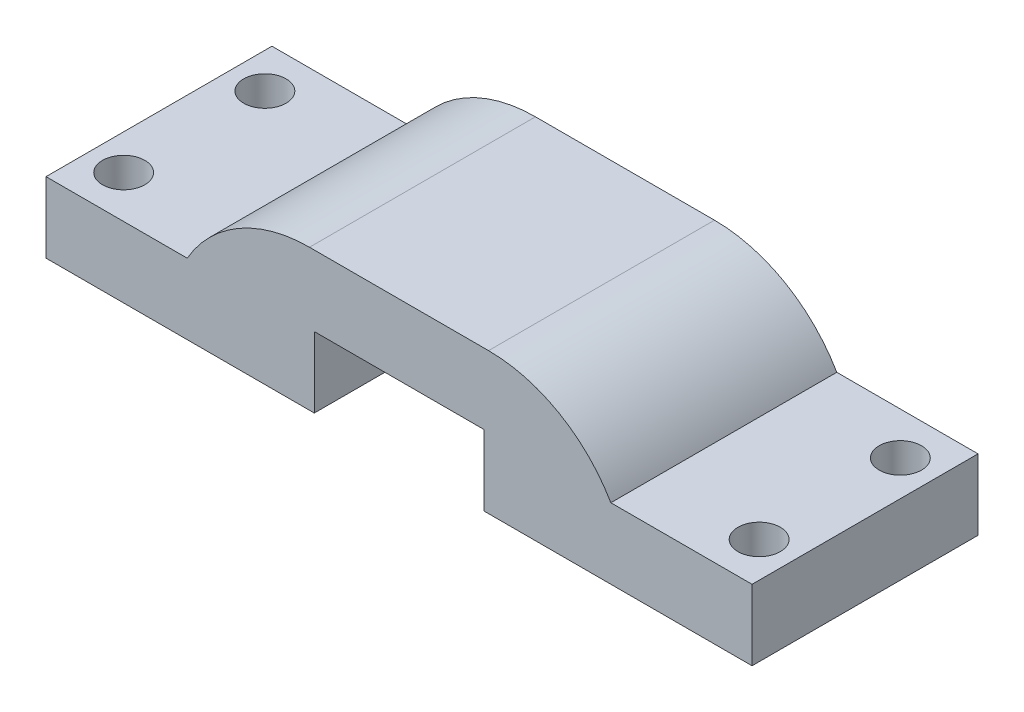
ISO-10303-21;
HEADER;
FILE_DESCRIPTION(('STEP AP214'),'2;1');
FILE_NAME('part.step','',(''),(''),'','','');
FILE_SCHEMA(('AUTOMOTIVE_DESIGN { 1 0 10303 214 1 1 1 1 }'));
ENDSEC;
DATA;
#1=APPLICATION_CONTEXT('core data for automotive mechanical design processes');
#2=APPLICATION_PROTOCOL_DEFINITION('international standard','automotive_design',2000,#1);
#3=PRODUCT_CONTEXT('',#1,'mechanical');
#4=PRODUCT('Part','Part','',(#3));
#5=PRODUCT_RELATED_PRODUCT_CATEGORY('part','',(#4));
#6=PRODUCT_DEFINITION_FORMATION('','',#4);
#7=PRODUCT_DEFINITION_CONTEXT('part definition',#1,'design');
#8=PRODUCT_DEFINITION('design','',#6,#7);
#9=PRODUCT_DEFINITION_SHAPE('','',#8);
#10=(LENGTH_UNIT() NAMED_UNIT(*) SI_UNIT(.MILLI.,.METRE.));
#11=(NAMED_UNIT(*) PLANE_ANGLE_UNIT() SI_UNIT($,.RADIAN.));
#12=(NAMED_UNIT(*) SI_UNIT($,.STERADIAN.) SOLID_ANGLE_UNIT());
#13=UNCERTAINTY_MEASURE_WITH_UNIT(LENGTH_MEASURE(1.E-05),#10,'distance_accuracy_value','');
#14=(GEOMETRIC_REPRESENTATION_CONTEXT(3) GLOBAL_UNCERTAINTY_ASSIGNED_CONTEXT((#13)) GLOBAL_UNIT_ASSIGNED_CONTEXT((#10,
#11,#12)) REPRESENTATION_CONTEXT('',''));
#15=CARTESIAN_POINT('',(0.,0.,0.));
#16=DIRECTION('',(0.,0.,1.));
#17=DIRECTION('',(1.,0.,0.));
#18=AXIS2_PLACEMENT_3D('',#15,#16,#17);
#19=CARTESIAN_POINT('',(9.86879837167113,0.,16.));
#20=DIRECTION('',(-1.,0.,0.));
#21=DIRECTION('',(0.,0.,1.));
#22=AXIS2_PLACEMENT_3D('',#19,#20,#21);
#23=PLANE('',#22);
#24=DIRECTION('',(0.,1.,0.));
#25=VECTOR('',#24,1.);
#26=CARTESIAN_POINT('',(9.86879837167113,0.,0.));
#27=LINE('',#26,#25);
#28=CARTESIAN_POINT('',(9.86879837167113,-27.1660126804046,0.));
#29=VERTEX_POINT('',#28);
#30=CARTESIAN_POINT('',(9.86879837167113,-22.1660126804046,0.));
#31=VERTEX_POINT('',#30);
#32=EDGE_CURVE('E130',#29,#31,#27,.T.);
#33=ORIENTED_EDGE('',*,*,#32,.F.);
#34=DIRECTION('',(0.,0.,-1.));
#35=VECTOR('',#34,1.);
#36=CARTESIAN_POINT('',(9.86879837167113,-27.1660126804046,16.));
#37=LINE('',#36,#35);
#38=CARTESIAN_POINT('',(9.86879837167113,-27.1660126804046,16.));
#39=VERTEX_POINT('',#38);
#40=EDGE_CURVE('E125',#39,#29,#37,.T.);
#41=ORIENTED_EDGE('',*,*,#40,.F.);
#42=DIRECTION('',(0.,1.,0.));
#43=VECTOR('',#42,1.);
#44=CARTESIAN_POINT('',(9.86879837167113,0.,16.));
#45=LINE('',#44,#43);
#46=CARTESIAN_POINT('',(9.86879837167113,-22.1660126804046,16.));
#47=VERTEX_POINT('',#46);
#48=EDGE_CURVE('E128',#39,#47,#45,.T.);
#49=ORIENTED_EDGE('',*,*,#48,.T.);
#50=DIRECTION('',(0.,0.,-1.));
#51=VECTOR('',#50,1.);
#52=CARTESIAN_POINT('',(9.86879837167113,-22.1660126804046,16.));
#53=LINE('',#52,#51);
#54=EDGE_CURVE('E171',#47,#31,#53,.T.);
#55=ORIENTED_EDGE('',*,*,#54,.T.);
#56=EDGE_LOOP('',(#33,#41,#49,#55));
#57=FACE_BOUND('',#56,.T.);
#58=ADVANCED_FACE('F36',(#57),#23,.T.);
#59=CARTESIAN_POINT('',(0.,-27.1660126804046,16.));
#60=DIRECTION('',(0.,1.,0.));
#61=DIRECTION('',(0.,0.,1.));
#62=AXIS2_PLACEMENT_3D('',#59,#60,#61);
#63=PLANE('',#62);
#64=CARTESIAN_POINT('',(26.3687983716711,-27.1660126804046,3.));
#65=DIRECTION('',(0.,1.,0.));
#66=DIRECTION('',(0.,0.,1.));
#67=AXIS2_PLACEMENT_3D('',#64,#65,#66);
#68=CIRCLE('',#67,1.5);
#69=CARTESIAN_POINT('',(26.3687983716711,-27.1660126804046,4.5));
#70=VERTEX_POINT('',#69);
#71=EDGE_CURVE('E333',#70,#70,#68,.T.);
#72=ORIENTED_EDGE('',*,*,#71,.T.);
#73=EDGE_LOOP('',(#72));
#74=FACE_BOUND('',#73,.T.);
#75=CARTESIAN_POINT('',(26.3687983716711,-27.1660126804046,13.));
#76=DIRECTION('',(0.,1.,0.));
#77=DIRECTION('',(0.,0.,1.));
#78=AXIS2_PLACEMENT_3D('',#75,#76,#77);
#79=CIRCLE('',#78,1.5);
#80=CARTESIAN_POINT('',(26.3687983716711,-27.1660126804046,14.5));
#81=VERTEX_POINT('',#80);
#82=EDGE_CURVE('E336',#81,#81,#79,.T.);
#83=ORIENTED_EDGE('',*,*,#82,.T.);
#84=EDGE_LOOP('',(#83));
#85=FACE_BOUND('',#84,.T.);
#86=DIRECTION('',(1.,0.,0.));
#87=VECTOR('',#86,1.);
#88=CARTESIAN_POINT('',(0.,-27.1660126804046,0.));
#89=LINE('',#88,#87);
#90=CARTESIAN_POINT('',(28.8687983716711,-27.1660126804046,0.));
#91=VERTEX_POINT('',#90);
#92=EDGE_CURVE('E173',#29,#91,#89,.T.);
#93=ORIENTED_EDGE('',*,*,#92,.T.);
#94=DIRECTION('',(0.,0.,-1.));
#95=VECTOR('',#94,1.);
#96=CARTESIAN_POINT('',(28.8687983716711,-27.1660126804046,16.));
#97=LINE('',#96,#95);
#98=CARTESIAN_POINT('',(28.8687983716711,-27.1660126804046,16.));
#99=VERTEX_POINT('',#98);
#100=EDGE_CURVE('E134',#99,#91,#97,.T.);
#101=ORIENTED_EDGE('',*,*,#100,.F.);
#102=DIRECTION('',(1.,0.,0.));
#103=VECTOR('',#102,1.);
#104=CARTESIAN_POINT('',(0.,-27.1660126804046,16.));
#105=LINE('',#104,#103);
#106=EDGE_CURVE('E137',#39,#99,#105,.T.);
#107=ORIENTED_EDGE('',*,*,#106,.F.);
#108=ORIENTED_EDGE('',*,*,#40,.T.);
#109=EDGE_LOOP('',(#93,#101,#107,#108));
#110=FACE_BOUND('',#109,.T.);
#111=ADVANCED_FACE('F138',(#74,#85,#110),#63,.F.);
#112=CARTESIAN_POINT('',(28.8687983716711,0.,16.));
#113=DIRECTION('',(-1.,0.,0.));
#114=DIRECTION('',(0.,-1.,0.));
#115=AXIS2_PLACEMENT_3D('',#112,#113,#114);
#116=PLANE('',#115);
#117=DIRECTION('',(0.,1.,0.));
#118=VECTOR('',#117,1.);
#119=CARTESIAN_POINT('',(28.8687983716711,0.,0.));
#120=LINE('',#119,#118);
#121=CARTESIAN_POINT('',(28.8687983716711,-22.1660126804046,0.));
#122=VERTEX_POINT('',#121);
#123=EDGE_CURVE('E176',#91,#122,#120,.T.);
#124=ORIENTED_EDGE('',*,*,#123,.T.);
#125=DIRECTION('',(0.,0.,-1.));
#126=VECTOR('',#125,1.);
#127=CARTESIAN_POINT('',(28.8687983716711,-22.1660126804046,16.));
#128=LINE('',#127,#126);
#129=CARTESIAN_POINT('',(28.8687983716711,-22.1660126804046,16.));
#130=VERTEX_POINT('',#129);
#131=EDGE_CURVE('E210',#130,#122,#128,.T.);
#132=ORIENTED_EDGE('',*,*,#131,.F.);
#133=DIRECTION('',(0.,1.,0.));
#134=VECTOR('',#133,1.);
#135=CARTESIAN_POINT('',(28.8687983716711,0.,16.));
#136=LINE('',#135,#134);
#137=EDGE_CURVE('E141',#99,#130,#136,.T.);
#138=ORIENTED_EDGE('',*,*,#137,.F.);
#139=ORIENTED_EDGE('',*,*,#100,.T.);
#140=EDGE_LOOP('',(#124,#132,#138,#139));
#141=FACE_BOUND('',#140,.T.);
#142=ADVANCED_FACE('F260',(#141),#116,.F.);
#143=CARTESIAN_POINT('',(0.,-22.1660126804046,16.));
#144=DIRECTION('',(0.,1.,0.));
#145=DIRECTION('',(0.,0.,1.));
#146=AXIS2_PLACEMENT_3D('',#143,#144,#145);
#147=PLANE('',#146);
#148=CARTESIAN_POINT('',(26.3687983716711,-22.1660126804046,3.));
#149=DIRECTION('',(0.,1.,0.));
#150=DIRECTION('',(0.,0.,1.));
#151=AXIS2_PLACEMENT_3D('',#148,#149,#150);
#152=CIRCLE('',#151,1.5);
#153=CARTESIAN_POINT('',(26.3687983716711,-22.1660126804046,4.5));
#154=VERTEX_POINT('',#153);
#155=EDGE_CURVE('E174',#154,#154,#152,.F.);
#156=ORIENTED_EDGE('',*,*,#155,.T.);
#157=EDGE_LOOP('',(#156));
#158=FACE_BOUND('',#157,.T.);
#159=CARTESIAN_POINT('',(26.3687983716711,-22.1660126804046,13.));
#160=DIRECTION('',(0.,1.,0.));
#161=DIRECTION('',(0.,0.,1.));
#162=AXIS2_PLACEMENT_3D('',#159,#160,#161);
#163=CIRCLE('',#162,1.5);
#164=CARTESIAN_POINT('',(26.3687983716711,-22.1660126804046,14.5));
#165=VERTEX_POINT('',#164);
#166=EDGE_CURVE('E213',#165,#165,#163,.F.);
#167=ORIENTED_EDGE('',*,*,#166,.T.);
#168=EDGE_LOOP('',(#167));
#169=FACE_BOUND('',#168,.T.);
#170=DIRECTION('',(1.,0.,0.));
#171=VECTOR('',#170,1.);
#172=CARTESIAN_POINT('',(0.,-22.1660126804046,0.));
#173=LINE('',#172,#171);
#174=CARTESIAN_POINT('',(18.8687983716711,-22.1660126804046,0.));
#175=VERTEX_POINT('',#174);
#176=EDGE_CURVE('E179',#175,#122,#173,.T.);
#177=ORIENTED_EDGE('',*,*,#176,.F.);
#178=DIRECTION('',(0.,0.,-1.));
#179=VECTOR('',#178,1.);
#180=CARTESIAN_POINT('',(18.8687983716711,-22.1660126804046,16.));
#181=LINE('',#180,#179);
#182=CARTESIAN_POINT('',(18.8687983716711,-22.1660126804046,16.));
#183=VERTEX_POINT('',#182);
#184=EDGE_CURVE('E207',#183,#175,#181,.T.);
#185=ORIENTED_EDGE('',*,*,#184,.F.);
#186=DIRECTION('',(1.,0.,0.));
#187=VECTOR('',#186,1.);
#188=CARTESIAN_POINT('',(0.,-22.1660126804046,16.));
#189=LINE('',#188,#187);
#190=EDGE_CURVE('E157',#183,#130,#189,.T.);
#191=ORIENTED_EDGE('',*,*,#190,.T.);
#192=ORIENTED_EDGE('',*,*,#131,.T.);
#193=EDGE_LOOP('',(#177,#185,#191,#192));
#194=FACE_BOUND('',#193,.T.);
#195=ADVANCED_FACE('F263',(#158,#169,#194),#147,.T.);
#196=CARTESIAN_POINT('',(0.,-17.1660126804046,16.));
#197=DIRECTION('',(0.,-1.,0.));
#198=DIRECTION('',(0.,0.,-1.));
#199=AXIS2_PLACEMENT_3D('',#196,#197,#198);
#200=PLANE('',#199);
#201=DIRECTION('',(-1.,0.,0.));
#202=VECTOR('',#201,1.);
#203=CARTESIAN_POINT('',(0.,-17.1660126804046,0.));
#204=LINE('',#203,#202);
#205=CARTESIAN_POINT('',(10.2085443338267,-17.1660126804046,0.));
#206=VERTEX_POINT('',#205);
#207=CARTESIAN_POINT('',(-2.47094759048447,-17.1660126804046,0.));
#208=VERTEX_POINT('',#207);
#209=EDGE_CURVE('E182',#206,#208,#204,.T.);
#210=ORIENTED_EDGE('',*,*,#209,.T.);
#211=DIRECTION('',(0.,0.,1.));
#212=VECTOR('',#211,1.);
#213=CARTESIAN_POINT('',(-2.47094759048447,-17.1660126804046,16.));
#214=LINE('',#213,#212);
#215=CARTESIAN_POINT('',(-2.47094759048447,-17.1660126804046,16.));
#216=VERTEX_POINT('',#215);
#217=EDGE_CURVE('E51',#208,#216,#214,.T.);
#218=ORIENTED_EDGE('',*,*,#217,.T.);
#219=DIRECTION('',(-1.,0.,0.));
#220=VECTOR('',#219,1.);
#221=CARTESIAN_POINT('',(0.,-17.1660126804046,16.));
#222=LINE('',#221,#220);
#223=CARTESIAN_POINT('',(10.2085443338267,-17.1660126804046,16.));
#224=VERTEX_POINT('',#223);
#225=EDGE_CURVE('E160',#224,#216,#222,.T.);
#226=ORIENTED_EDGE('',*,*,#225,.F.);
#227=DIRECTION('',(0.,0.,-1.));
#228=VECTOR('',#227,1.);
#229=CARTESIAN_POINT('',(10.2085443338267,-17.1660126804046,16.));
#230=LINE('',#229,#228);
#231=EDGE_CURVE('E221',#224,#206,#230,.T.);
#232=ORIENTED_EDGE('',*,*,#231,.T.);
#233=EDGE_LOOP('',(#210,#218,#226,#232));
#234=FACE_BOUND('',#233,.T.);
#235=ADVANCED_FACE('F226',(#234),#200,.F.);
#236=CARTESIAN_POINT('',(0.,-22.1660126804046,16.));
#237=DIRECTION('',(0.,-1.,0.));
#238=DIRECTION('',(0.,0.,-1.));
#239=AXIS2_PLACEMENT_3D('',#236,#237,#238);
#240=PLANE('',#239);
#241=CARTESIAN_POINT('',(-18.6312016283289,-22.1660126804046,13.));
#242=DIRECTION('',(0.,-1.,0.));
#243=DIRECTION('',(0.,0.,-1.));
#244=AXIS2_PLACEMENT_3D('',#241,#242,#243);
#245=CIRCLE('',#244,1.5);
#246=CARTESIAN_POINT('',(-18.6312016283289,-22.1660126804046,11.5));
#247=VERTEX_POINT('',#246);
#248=EDGE_CURVE('E153',#247,#247,#245,.F.);
#249=ORIENTED_EDGE('',*,*,#248,.F.);
#250=EDGE_LOOP('',(#249));
#251=FACE_BOUND('',#250,.T.);
#252=CARTESIAN_POINT('',(-18.6312016283289,-22.1660126804046,3.));
#253=DIRECTION('',(0.,-1.,0.));
#254=DIRECTION('',(0.,0.,-1.));
#255=AXIS2_PLACEMENT_3D('',#252,#253,#254);
#256=CIRCLE('',#255,1.5);
#257=CARTESIAN_POINT('',(-18.6312016283289,-22.1660126804046,1.5));
#258=VERTEX_POINT('',#257);
#259=EDGE_CURVE('E326',#258,#258,#256,.F.);
#260=ORIENTED_EDGE('',*,*,#259,.F.);
#261=EDGE_LOOP('',(#260));
#262=FACE_BOUND('',#261,.T.);
#263=DIRECTION('',(-1.,0.,0.));
#264=VECTOR('',#263,1.);
#265=CARTESIAN_POINT('',(0.,-22.1660126804046,0.));
#266=LINE('',#265,#264);
#267=CARTESIAN_POINT('',(-11.1312016283289,-22.1660126804046,0.));
#268=VERTEX_POINT('',#267);
#269=CARTESIAN_POINT('',(-21.1312016283289,-22.1660126804046,0.));
#270=VERTEX_POINT('',#269);
#271=EDGE_CURVE('E184',#268,#270,#266,.T.);
#272=ORIENTED_EDGE('',*,*,#271,.T.);
#273=DIRECTION('',(0.,0.,-1.));
#274=VECTOR('',#273,1.);
#275=CARTESIAN_POINT('',(-21.1312016283289,-22.1660126804046,16.));
#276=LINE('',#275,#274);
#277=CARTESIAN_POINT('',(-21.1312016283289,-22.1660126804046,16.));
#278=VERTEX_POINT('',#277);
#279=EDGE_CURVE('E201',#278,#270,#276,.T.);
#280=ORIENTED_EDGE('',*,*,#279,.F.);
#281=DIRECTION('',(-1.,0.,0.));
#282=VECTOR('',#281,1.);
#283=CARTESIAN_POINT('',(0.,-22.1660126804046,16.));
#284=LINE('',#283,#282);
#285=CARTESIAN_POINT('',(-11.1312016283289,-22.1660126804046,16.));
#286=VERTEX_POINT('',#285);
#287=EDGE_CURVE('E162',#286,#278,#284,.T.);
#288=ORIENTED_EDGE('',*,*,#287,.F.);
#289=DIRECTION('',(0.,0.,-1.));
#290=VECTOR('',#289,1.);
#291=CARTESIAN_POINT('',(-11.1312016283289,-22.1660126804046,16.));
#292=LINE('',#291,#290);
#293=EDGE_CURVE('E204',#286,#268,#292,.T.);
#294=ORIENTED_EDGE('',*,*,#293,.T.);
#295=EDGE_LOOP('',(#272,#280,#288,#294));
#296=FACE_BOUND('',#295,.T.);
#297=ADVANCED_FACE('F239',(#251,#262,#296),#240,.F.);
#298=CARTESIAN_POINT('',(-21.1312016283289,0.,16.));
#299=DIRECTION('',(1.,0.,0.));
#300=DIRECTION('',(0.,1.,0.));
#301=AXIS2_PLACEMENT_3D('',#298,#299,#300);
#302=PLANE('',#301);
#303=DIRECTION('',(0.,-1.,0.));
#304=VECTOR('',#303,1.);
#305=CARTESIAN_POINT('',(-21.1312016283289,0.,0.));
#306=LINE('',#305,#304);
#307=CARTESIAN_POINT('',(-21.1312016283289,-27.1660126804046,0.));
#308=VERTEX_POINT('',#307);
#309=EDGE_CURVE('E186',#270,#308,#306,.T.);
#310=ORIENTED_EDGE('',*,*,#309,.T.);
#311=DIRECTION('',(0.,0.,-1.));
#312=VECTOR('',#311,1.);
#313=CARTESIAN_POINT('',(-21.1312016283289,-27.1660126804046,16.));
#314=LINE('',#313,#312);
#315=CARTESIAN_POINT('',(-21.1312016283289,-27.1660126804046,16.));
#316=VERTEX_POINT('',#315);
#317=EDGE_CURVE('E198',#316,#308,#314,.T.);
#318=ORIENTED_EDGE('',*,*,#317,.F.);
#319=DIRECTION('',(0.,-1.,0.));
#320=VECTOR('',#319,1.);
#321=CARTESIAN_POINT('',(-21.1312016283289,0.,16.));
#322=LINE('',#321,#320);
#323=EDGE_CURVE('E164',#278,#316,#322,.T.);
#324=ORIENTED_EDGE('',*,*,#323,.F.);
#325=ORIENTED_EDGE('',*,*,#279,.T.);
#326=EDGE_LOOP('',(#310,#318,#324,#325));
#327=FACE_BOUND('',#326,.T.);
#328=ADVANCED_FACE('F246',(#327),#302,.F.);
#329=CARTESIAN_POINT('',(0.,-27.1660126804046,16.));
#330=DIRECTION('',(0.,1.,0.));
#331=DIRECTION('',(0.,0.,1.));
#332=AXIS2_PLACEMENT_3D('',#329,#330,#331);
#333=PLANE('',#332);
#334=CARTESIAN_POINT('',(-18.6312016283289,-27.1660126804046,13.));
#335=DIRECTION('',(0.,1.,0.));
#336=DIRECTION('',(0.,0.,1.));
#337=AXIS2_PLACEMENT_3D('',#334,#335,#336);
#338=CIRCLE('',#337,1.5);
#339=CARTESIAN_POINT('',(-18.6312016283289,-27.1660126804046,14.5));
#340=VERTEX_POINT('',#339);
#341=EDGE_CURVE('E330',#340,#340,#338,.T.);
#342=ORIENTED_EDGE('',*,*,#341,.T.);
#343=EDGE_LOOP('',(#342));
#344=FACE_BOUND('',#343,.T.);
#345=CARTESIAN_POINT('',(-18.6312016283289,-27.1660126804046,3.));
#346=DIRECTION('',(0.,1.,0.));
#347=DIRECTION('',(0.,0.,1.));
#348=AXIS2_PLACEMENT_3D('',#345,#346,#347);
#349=CIRCLE('',#348,1.5);
#350=CARTESIAN_POINT('',(-18.6312016283289,-27.1660126804046,4.5));
#351=VERTEX_POINT('',#350);
#352=EDGE_CURVE('E328',#351,#351,#349,.T.);
#353=ORIENTED_EDGE('',*,*,#352,.T.);
#354=EDGE_LOOP('',(#353));
#355=FACE_BOUND('',#354,.T.);
#356=DIRECTION('',(1.,0.,0.));
#357=VECTOR('',#356,1.);
#358=CARTESIAN_POINT('',(0.,-27.1660126804046,0.));
#359=LINE('',#358,#357);
#360=CARTESIAN_POINT('',(-2.13120162832888,-27.1660126804046,0.));
#361=VERTEX_POINT('',#360);
#362=EDGE_CURVE('E188',#308,#361,#359,.T.);
#363=ORIENTED_EDGE('',*,*,#362,.T.);
#364=DIRECTION('',(0.,0.,-1.));
#365=VECTOR('',#364,1.);
#366=CARTESIAN_POINT('',(-2.13120162832888,-27.1660126804046,16.));
#367=LINE('',#366,#365);
#368=CARTESIAN_POINT('',(-2.13120162832888,-27.1660126804046,16.));
#369=VERTEX_POINT('',#368);
#370=EDGE_CURVE('E195',#369,#361,#367,.T.);
#371=ORIENTED_EDGE('',*,*,#370,.F.);
#372=DIRECTION('',(1.,0.,0.));
#373=VECTOR('',#372,1.);
#374=CARTESIAN_POINT('',(0.,-27.1660126804046,16.));
#375=LINE('',#374,#373);
#376=EDGE_CURVE('E166',#316,#369,#375,.T.);
#377=ORIENTED_EDGE('',*,*,#376,.F.);
#378=ORIENTED_EDGE('',*,*,#317,.T.);
#379=EDGE_LOOP('',(#363,#371,#377,#378));
#380=FACE_BOUND('',#379,.T.);
#381=ADVANCED_FACE('F249',(#344,#355,#380),#333,.F.);
#382=CARTESIAN_POINT('',(-2.13120162832888,0.,16.));
#383=DIRECTION('',(-1.,0.,0.));
#384=DIRECTION('',(0.,0.,1.));
#385=AXIS2_PLACEMENT_3D('',#382,#383,#384);
#386=PLANE('',#385);
#387=DIRECTION('',(0.,1.,0.));
#388=VECTOR('',#387,1.);
#389=CARTESIAN_POINT('',(-2.13120162832888,0.,0.));
#390=LINE('',#389,#388);
#391=CARTESIAN_POINT('',(-2.13120162832888,-22.1660126804046,0.));
#392=VERTEX_POINT('',#391);
#393=EDGE_CURVE('E150',#361,#392,#390,.T.);
#394=ORIENTED_EDGE('',*,*,#393,.T.);
#395=DIRECTION('',(0.,0.,-1.));
#396=VECTOR('',#395,1.);
#397=CARTESIAN_POINT('',(-2.13120162832888,-22.1660126804046,16.));
#398=LINE('',#397,#396);
#399=CARTESIAN_POINT('',(-2.13120162832888,-22.1660126804046,16.));
#400=VERTEX_POINT('',#399);
#401=EDGE_CURVE('E192',#400,#392,#398,.T.);
#402=ORIENTED_EDGE('',*,*,#401,.F.);
#403=DIRECTION('',(0.,1.,0.));
#404=VECTOR('',#403,1.);
#405=CARTESIAN_POINT('',(-2.13120162832888,0.,16.));
#406=LINE('',#405,#404);
#407=EDGE_CURVE('E168',#369,#400,#406,.T.);
#408=ORIENTED_EDGE('',*,*,#407,.F.);
#409=ORIENTED_EDGE('',*,*,#370,.T.);
#410=EDGE_LOOP('',(#394,#402,#408,#409));
#411=FACE_BOUND('',#410,.T.);
#412=ADVANCED_FACE('F254',(#411),#386,.F.);
#413=CARTESIAN_POINT('',(0.,-22.1660126804046,16.));
#414=DIRECTION('',(0.,1.,0.));
#415=DIRECTION('',(0.,0.,1.));
#416=AXIS2_PLACEMENT_3D('',#413,#414,#415);
#417=PLANE('',#416);
#418=DIRECTION('',(1.,0.,0.));
#419=VECTOR('',#418,1.);
#420=CARTESIAN_POINT('',(0.,-22.1660126804046,0.));
#421=LINE('',#420,#419);
#422=EDGE_CURVE('E147',#392,#31,#421,.T.);
#423=ORIENTED_EDGE('',*,*,#422,.T.);
#424=ORIENTED_EDGE('',*,*,#54,.F.);
#425=DIRECTION('',(1.,0.,0.));
#426=VECTOR('',#425,1.);
#427=CARTESIAN_POINT('',(0.,-22.1660126804046,16.));
#428=LINE('',#427,#426);
#429=EDGE_CURVE('E145',#400,#47,#428,.T.);
#430=ORIENTED_EDGE('',*,*,#429,.F.);
#431=ORIENTED_EDGE('',*,*,#401,.T.);
#432=EDGE_LOOP('',(#423,#424,#430,#431));
#433=FACE_BOUND('',#432,.T.);
#434=ADVANCED_FACE('F257',(#433),#417,.F.);
#435=CARTESIAN_POINT('',(0.,0.,16.));
#436=DIRECTION('',(0.,0.,1.));
#437=DIRECTION('',(1.,0.,0.));
#438=AXIS2_PLACEMENT_3D('',#435,#436,#437);
#439=PLANE('',#438);
#440=ORIENTED_EDGE('',*,*,#225,.T.);
#441=CARTESIAN_POINT('',(-2.47094759048447,-27.1660126804046,16.));
#442=DIRECTION('',(0.,0.,1.));
#443=DIRECTION('',(1.,0.,0.));
#444=AXIS2_PLACEMENT_3D('',#441,#442,#443);
#445=CIRCLE('',#444,10.);
#446=EDGE_CURVE('E11',#216,#286,#445,.T.);
#447=ORIENTED_EDGE('',*,*,#446,.T.);
#448=ORIENTED_EDGE('',*,*,#287,.T.);
#449=ORIENTED_EDGE('',*,*,#323,.T.);
#450=ORIENTED_EDGE('',*,*,#376,.T.);
#451=ORIENTED_EDGE('',*,*,#407,.T.);
#452=ORIENTED_EDGE('',*,*,#429,.T.);
#453=ORIENTED_EDGE('',*,*,#48,.F.);
#454=ORIENTED_EDGE('',*,*,#106,.T.);
#455=ORIENTED_EDGE('',*,*,#137,.T.);
#456=ORIENTED_EDGE('',*,*,#190,.F.);
#457=CARTESIAN_POINT('',(10.2085443338267,-27.1660126804046,16.));
#458=DIRECTION('',(0.,0.,1.));
#459=DIRECTION('',(1.,0.,0.));
#460=AXIS2_PLACEMENT_3D('',#457,#458,#459);
#461=CIRCLE('',#460,10.);
#462=EDGE_CURVE('E44',#183,#224,#461,.T.);
#463=ORIENTED_EDGE('',*,*,#462,.T.);
#464=EDGE_LOOP('',(#440,#447,#448,#449,#450,#451,#452,#453,#454,#455,#456,#463));
#465=FACE_BOUND('',#464,.T.);
#466=ADVANCED_FACE('F143',(#465),#439,.T.);
#467=CARTESIAN_POINT('',(0.,0.,0.));
#468=DIRECTION('',(0.,0.,1.));
#469=DIRECTION('',(1.,0.,0.));
#470=AXIS2_PLACEMENT_3D('',#467,#468,#469);
#471=PLANE('',#470);
#472=ORIENTED_EDGE('',*,*,#271,.F.);
#473=CARTESIAN_POINT('',(-2.47094759048447,-27.1660126804046,0.));
#474=DIRECTION('',(0.,0.,1.));
#475=DIRECTION('',(1.,0.,0.));
#476=AXIS2_PLACEMENT_3D('',#473,#474,#475);
#477=CIRCLE('',#476,10.);
#478=EDGE_CURVE('E219',#268,#208,#477,.F.);
#479=ORIENTED_EDGE('',*,*,#478,.T.);
#480=ORIENTED_EDGE('',*,*,#209,.F.);
#481=CARTESIAN_POINT('',(10.2085443338267,-27.1660126804046,0.));
#482=DIRECTION('',(0.,0.,1.));
#483=DIRECTION('',(1.,0.,0.));
#484=AXIS2_PLACEMENT_3D('',#481,#482,#483);
#485=CIRCLE('',#484,10.);
#486=EDGE_CURVE('E133',#206,#175,#485,.F.);
#487=ORIENTED_EDGE('',*,*,#486,.T.);
#488=ORIENTED_EDGE('',*,*,#176,.T.);
#489=ORIENTED_EDGE('',*,*,#123,.F.);
#490=ORIENTED_EDGE('',*,*,#92,.F.);
#491=ORIENTED_EDGE('',*,*,#32,.T.);
#492=ORIENTED_EDGE('',*,*,#422,.F.);
#493=ORIENTED_EDGE('',*,*,#393,.F.);
#494=ORIENTED_EDGE('',*,*,#362,.F.);
#495=ORIENTED_EDGE('',*,*,#309,.F.);
#496=EDGE_LOOP('',(#472,#479,#480,#487,#488,#489,#490,#491,#492,#493,#494,#495));
#497=FACE_BOUND('',#496,.T.);
#498=ADVANCED_FACE('F230',(#497),#471,.F.);
#499=CARTESIAN_POINT('',(-18.6312016283289,22.8339873195954,3.));
#500=DIRECTION('',(0.,-1.,0.));
#501=DIRECTION('',(0.,0.,-1.));
#502=AXIS2_PLACEMENT_3D('',#499,#500,#501);
#503=CYLINDRICAL_SURFACE('',#502,1.5);
#504=ORIENTED_EDGE('',*,*,#352,.F.);
#505=EDGE_LOOP('',(#504));
#506=FACE_BOUND('',#505,.T.);
#507=ORIENTED_EDGE('',*,*,#259,.T.);
#508=EDGE_LOOP('',(#507));
#509=FACE_BOUND('',#508,.T.);
#510=ADVANCED_FACE('F300',(#506,#509),#503,.F.);
#511=CARTESIAN_POINT('',(-18.6312016283289,22.8339873195954,13.));
#512=DIRECTION('',(0.,-1.,0.));
#513=DIRECTION('',(0.,0.,-1.));
#514=AXIS2_PLACEMENT_3D('',#511,#512,#513);
#515=CYLINDRICAL_SURFACE('',#514,1.5);
#516=ORIENTED_EDGE('',*,*,#341,.F.);
#517=EDGE_LOOP('',(#516));
#518=FACE_BOUND('',#517,.T.);
#519=ORIENTED_EDGE('',*,*,#248,.T.);
#520=EDGE_LOOP('',(#519));
#521=FACE_BOUND('',#520,.T.);
#522=ADVANCED_FACE('F293',(#518,#521),#515,.F.);
#523=CARTESIAN_POINT('',(26.3687983716711,22.8339873195954,13.));
#524=DIRECTION('',(0.,-1.,0.));
#525=DIRECTION('',(0.,0.,-1.));
#526=AXIS2_PLACEMENT_3D('',#523,#524,#525);
#527=CYLINDRICAL_SURFACE('',#526,1.5);
#528=ORIENTED_EDGE('',*,*,#166,.F.);
#529=EDGE_LOOP('',(#528));
#530=FACE_BOUND('',#529,.T.);
#531=ORIENTED_EDGE('',*,*,#82,.F.);
#532=EDGE_LOOP('',(#531));
#533=FACE_BOUND('',#532,.T.);
#534=ADVANCED_FACE('F287',(#530,#533),#527,.F.);
#535=CARTESIAN_POINT('',(26.3687983716711,22.8339873195954,3.));
#536=DIRECTION('',(0.,-1.,0.));
#537=DIRECTION('',(0.,0.,-1.));
#538=AXIS2_PLACEMENT_3D('',#535,#536,#537);
#539=CYLINDRICAL_SURFACE('',#538,1.5);
#540=ORIENTED_EDGE('',*,*,#155,.F.);
#541=EDGE_LOOP('',(#540));
#542=FACE_BOUND('',#541,.T.);
#543=ORIENTED_EDGE('',*,*,#71,.F.);
#544=EDGE_LOOP('',(#543));
#545=FACE_BOUND('',#544,.T.);
#546=ADVANCED_FACE('F282',(#542,#545),#539,.F.);
#547=CARTESIAN_POINT('',(-2.47094759048447,-27.1660126804046,16.));
#548=DIRECTION('',(0.,0.,1.));
#549=DIRECTION('',(1.,0.,0.));
#550=AXIS2_PLACEMENT_3D('',#547,#548,#549);
#551=CYLINDRICAL_SURFACE('',#550,10.);
#552=ORIENTED_EDGE('',*,*,#446,.F.);
#553=ORIENTED_EDGE('',*,*,#217,.F.);
#554=ORIENTED_EDGE('',*,*,#478,.F.);
#555=ORIENTED_EDGE('',*,*,#293,.F.);
#556=EDGE_LOOP('',(#552,#553,#554,#555));
#557=FACE_BOUND('',#556,.T.);
#558=ADVANCED_FACE('F236',(#557),#551,.T.);
#559=CARTESIAN_POINT('',(10.2085443338267,-27.1660126804046,16.));
#560=DIRECTION('',(0.,0.,-1.));
#561=DIRECTION('',(-1.,0.,0.));
#562=AXIS2_PLACEMENT_3D('',#559,#560,#561);
#563=CYLINDRICAL_SURFACE('',#562,10.);
#564=ORIENTED_EDGE('',*,*,#462,.F.);
#565=ORIENTED_EDGE('',*,*,#184,.T.);
#566=ORIENTED_EDGE('',*,*,#486,.F.);
#567=ORIENTED_EDGE('',*,*,#231,.F.);
#568=EDGE_LOOP('',(#564,#565,#566,#567));
#569=FACE_BOUND('',#568,.T.);
#570=ADVANCED_FACE('F38',(#569),#563,.T.);
#571=CLOSED_SHELL('',(#58,#111,#142,#195,#235,#297,#328,#381,#412,#434,#466,#498,#510,#522,#534,
#546,#558,#570));
#572=MANIFOLD_SOLID_BREP('B2',#571);
#573=ADVANCED_BREP_SHAPE_REPRESENTATION('',(#18,#572),#14);
#574=SHAPE_DEFINITION_REPRESENTATION(#9,#573);
ENDSEC;
END-ISO-10303-21;
